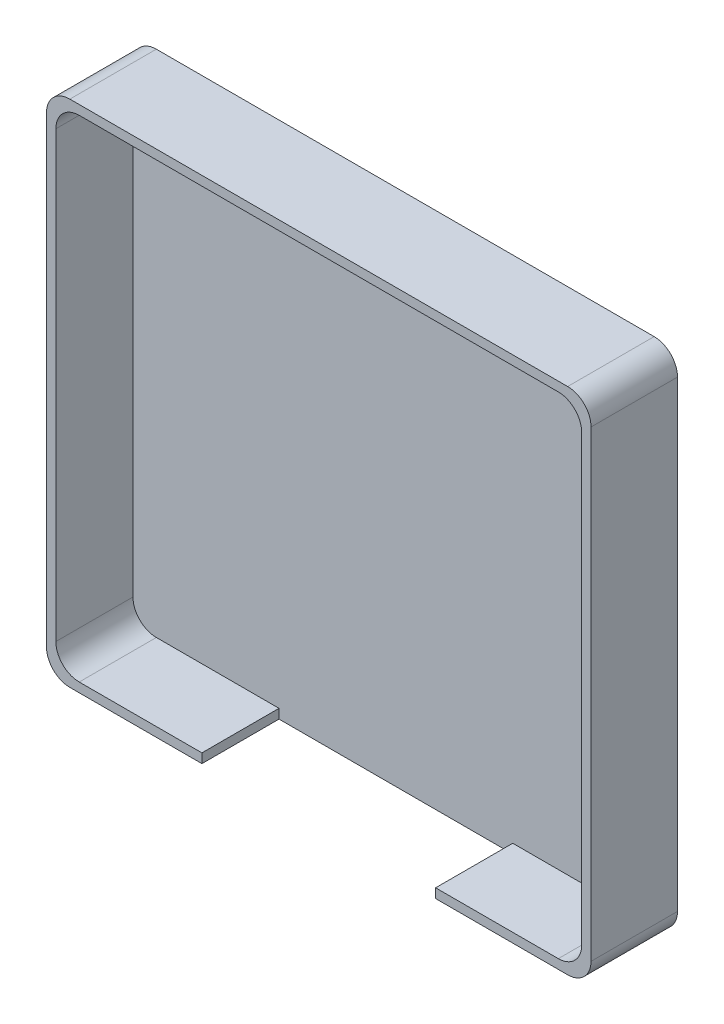
ISO-10303-21;
HEADER;
FILE_DESCRIPTION(('STEP AP214'),'2;1');
FILE_NAME('part.step','',(''),(''),'','','');
FILE_SCHEMA(('AUTOMOTIVE_DESIGN { 1 0 10303 214 1 1 1 1 }'));
ENDSEC;
DATA;
#1=APPLICATION_CONTEXT('core data for automotive mechanical design processes');
#2=APPLICATION_PROTOCOL_DEFINITION('international standard','automotive_design',2000,#1);
#3=PRODUCT_CONTEXT('',#1,'mechanical');
#4=PRODUCT('Part','Part','',(#3));
#5=PRODUCT_RELATED_PRODUCT_CATEGORY('part','',(#4));
#6=PRODUCT_DEFINITION_FORMATION('','',#4);
#7=PRODUCT_DEFINITION_CONTEXT('part definition',#1,'design');
#8=PRODUCT_DEFINITION('design','',#6,#7);
#9=PRODUCT_DEFINITION_SHAPE('','',#8);
#10=(LENGTH_UNIT() NAMED_UNIT(*) SI_UNIT(.MILLI.,.METRE.));
#11=(NAMED_UNIT(*) PLANE_ANGLE_UNIT() SI_UNIT($,.RADIAN.));
#12=(NAMED_UNIT(*) SI_UNIT($,.STERADIAN.) SOLID_ANGLE_UNIT());
#13=UNCERTAINTY_MEASURE_WITH_UNIT(LENGTH_MEASURE(1.E-05),#10,'distance_accuracy_value','');
#14=(GEOMETRIC_REPRESENTATION_CONTEXT(3) GLOBAL_UNCERTAINTY_ASSIGNED_CONTEXT((#13)) GLOBAL_UNIT_ASSIGNED_CONTEXT((#10,
#11,#12)) REPRESENTATION_CONTEXT('',''));
#15=CARTESIAN_POINT('',(0.,0.,0.));
#16=DIRECTION('',(0.,0.,1.));
#17=DIRECTION('',(1.,0.,0.));
#18=AXIS2_PLACEMENT_3D('',#15,#16,#17);
#19=CARTESIAN_POINT('',(22.5,-21.,0.8));
#20=DIRECTION('',(0.,-1.,0.));
#21=DIRECTION('',(1.,0.,0.));
#22=AXIS2_PLACEMENT_3D('',#19,#20,#21);
#23=PLANE('',#22);
#24=DIRECTION('',(1.,0.,0.));
#25=VECTOR('',#24,1.);
#26=CARTESIAN_POINT('',(22.5,-21.,7.4));
#27=LINE('',#26,#25);
#28=CARTESIAN_POINT('',(10.,-21.,7.4));
#29=VERTEX_POINT('',#28);
#30=CARTESIAN_POINT('',(20.5,-21.,7.4));
#31=VERTEX_POINT('',#30);
#32=EDGE_CURVE('E182',#29,#31,#27,.T.);
#33=ORIENTED_EDGE('',*,*,#32,.T.);
#34=DIRECTION('',(0.,0.,1.));
#35=VECTOR('',#34,1.);
#36=CARTESIAN_POINT('',(20.5,-21.,0.8));
#37=LINE('',#36,#35);
#38=CARTESIAN_POINT('',(20.5,-21.,0.8));
#39=VERTEX_POINT('',#38);
#40=EDGE_CURVE('E306',#31,#39,#37,.F.);
#41=ORIENTED_EDGE('',*,*,#40,.T.);
#42=DIRECTION('',(1.,0.,0.));
#43=VECTOR('',#42,1.);
#44=CARTESIAN_POINT('',(22.5,-21.,0.8));
#45=LINE('',#44,#43);
#46=CARTESIAN_POINT('',(10.,-21.,0.8));
#47=VERTEX_POINT('',#46);
#48=EDGE_CURVE('E212',#47,#39,#45,.T.);
#49=ORIENTED_EDGE('',*,*,#48,.F.);
#50=DIRECTION('',(0.,0.,-1.));
#51=VECTOR('',#50,1.);
#52=CARTESIAN_POINT('',(10.,-21.,7.4));
#53=LINE('',#52,#51);
#54=EDGE_CURVE('E192',#29,#47,#53,.T.);
#55=ORIENTED_EDGE('',*,*,#54,.F.);
#56=EDGE_LOOP('',(#33,#41,#49,#55));
#57=FACE_BOUND('',#56,.T.);
#58=ADVANCED_FACE('F33',(#57),#23,.F.);
#59=CARTESIAN_POINT('',(23.3,-21.8,7.4));
#60=DIRECTION('',(-1.,0.,0.));
#61=DIRECTION('',(0.,0.,1.));
#62=AXIS2_PLACEMENT_3D('',#59,#60,#61);
#63=PLANE('',#62);
#64=DIRECTION('',(0.,1.,0.));
#65=VECTOR('',#64,1.);
#66=CARTESIAN_POINT('',(23.3,-21.8,0.));
#67=LINE('',#66,#65);
#68=CARTESIAN_POINT('',(23.3,-19.8,0.));
#69=VERTEX_POINT('',#68);
#70=CARTESIAN_POINT('',(23.3,19.8,0.));
#71=VERTEX_POINT('',#70);
#72=EDGE_CURVE('E221',#69,#71,#67,.T.);
#73=ORIENTED_EDGE('',*,*,#72,.T.);
#74=DIRECTION('',(0.,0.,-1.));
#75=VECTOR('',#74,1.);
#76=CARTESIAN_POINT('',(23.3,19.8,7.4));
#77=LINE('',#76,#75);
#78=CARTESIAN_POINT('',(23.3,19.8,7.4));
#79=VERTEX_POINT('',#78);
#80=EDGE_CURVE('E264',#71,#79,#77,.F.);
#81=ORIENTED_EDGE('',*,*,#80,.T.);
#82=DIRECTION('',(0.,1.,0.));
#83=VECTOR('',#82,1.);
#84=CARTESIAN_POINT('',(23.3,-21.8,7.4));
#85=LINE('',#84,#83);
#86=CARTESIAN_POINT('',(23.3,-19.8,7.4));
#87=VERTEX_POINT('',#86);
#88=EDGE_CURVE('E227',#87,#79,#85,.T.);
#89=ORIENTED_EDGE('',*,*,#88,.F.);
#90=DIRECTION('',(0.,0.,-1.));
#91=VECTOR('',#90,1.);
#92=CARTESIAN_POINT('',(23.3,-19.8,7.4));
#93=LINE('',#92,#91);
#94=EDGE_CURVE('E261',#87,#69,#93,.T.);
#95=ORIENTED_EDGE('',*,*,#94,.T.);
#96=EDGE_LOOP('',(#73,#81,#89,#95));
#97=FACE_BOUND('',#96,.T.);
#98=ADVANCED_FACE('F355',(#97),#63,.F.);
#99=CARTESIAN_POINT('',(-23.3,21.8,7.4));
#100=DIRECTION('',(0.,-1.,0.));
#101=DIRECTION('',(0.,0.,-1.));
#102=AXIS2_PLACEMENT_3D('',#99,#100,#101);
#103=PLANE('',#102);
#104=DIRECTION('',(-1.,0.,0.));
#105=VECTOR('',#104,1.);
#106=CARTESIAN_POINT('',(-23.3,21.8,7.4));
#107=LINE('',#106,#105);
#108=CARTESIAN_POINT('',(21.3,21.8,7.4));
#109=VERTEX_POINT('',#108);
#110=CARTESIAN_POINT('',(-21.3,21.8,7.4));
#111=VERTEX_POINT('',#110);
#112=EDGE_CURVE('E229',#109,#111,#107,.T.);
#113=ORIENTED_EDGE('',*,*,#112,.F.);
#114=DIRECTION('',(0.,0.,-1.));
#115=VECTOR('',#114,1.);
#116=CARTESIAN_POINT('',(21.3,21.8,7.4));
#117=LINE('',#116,#115);
#118=CARTESIAN_POINT('',(21.3,21.8,0.));
#119=VERTEX_POINT('',#118);
#120=EDGE_CURVE('E250',#109,#119,#117,.T.);
#121=ORIENTED_EDGE('',*,*,#120,.T.);
#122=DIRECTION('',(-1.,0.,0.));
#123=VECTOR('',#122,1.);
#124=CARTESIAN_POINT('',(-23.3,21.8,0.));
#125=LINE('',#124,#123);
#126=CARTESIAN_POINT('',(-21.3,21.8,0.));
#127=VERTEX_POINT('',#126);
#128=EDGE_CURVE('E241',#119,#127,#125,.T.);
#129=ORIENTED_EDGE('',*,*,#128,.T.);
#130=DIRECTION('',(0.,0.,-1.));
#131=VECTOR('',#130,1.);
#132=CARTESIAN_POINT('',(-21.3,21.8,7.4));
#133=LINE('',#132,#131);
#134=EDGE_CURVE('E238',#127,#111,#133,.F.);
#135=ORIENTED_EDGE('',*,*,#134,.T.);
#136=EDGE_LOOP('',(#113,#121,#129,#135));
#137=FACE_BOUND('',#136,.T.);
#138=ADVANCED_FACE('F360',(#137),#103,.F.);
#139=CARTESIAN_POINT('',(-23.3,-21.8,7.4));
#140=DIRECTION('',(1.,0.,0.));
#141=DIRECTION('',(0.,0.,-1.));
#142=AXIS2_PLACEMENT_3D('',#139,#140,#141);
#143=PLANE('',#142);
#144=DIRECTION('',(0.,-1.,0.));
#145=VECTOR('',#144,1.);
#146=CARTESIAN_POINT('',(-23.3,-21.8,7.4));
#147=LINE('',#146,#145);
#148=CARTESIAN_POINT('',(-23.3,19.8,7.4));
#149=VERTEX_POINT('',#148);
#150=CARTESIAN_POINT('',(-23.3,-19.8,7.4));
#151=VERTEX_POINT('',#150);
#152=EDGE_CURVE('E233',#149,#151,#147,.T.);
#153=ORIENTED_EDGE('',*,*,#152,.F.);
#154=DIRECTION('',(0.,0.,-1.));
#155=VECTOR('',#154,1.);
#156=CARTESIAN_POINT('',(-23.3,19.8,7.4));
#157=LINE('',#156,#155);
#158=CARTESIAN_POINT('',(-23.3,19.8,0.));
#159=VERTEX_POINT('',#158);
#160=EDGE_CURVE('E281',#149,#159,#157,.T.);
#161=ORIENTED_EDGE('',*,*,#160,.T.);
#162=DIRECTION('',(0.,-1.,0.));
#163=VECTOR('',#162,1.);
#164=CARTESIAN_POINT('',(-23.3,-21.8,0.));
#165=LINE('',#164,#163);
#166=CARTESIAN_POINT('',(-23.3,-19.8,0.));
#167=VERTEX_POINT('',#166);
#168=EDGE_CURVE('E244',#159,#167,#165,.T.);
#169=ORIENTED_EDGE('',*,*,#168,.T.);
#170=DIRECTION('',(0.,0.,-1.));
#171=VECTOR('',#170,1.);
#172=CARTESIAN_POINT('',(-23.3,-19.8,7.4));
#173=LINE('',#172,#171);
#174=EDGE_CURVE('E279',#167,#151,#173,.F.);
#175=ORIENTED_EDGE('',*,*,#174,.T.);
#176=EDGE_LOOP('',(#153,#161,#169,#175));
#177=FACE_BOUND('',#176,.T.);
#178=ADVANCED_FACE('F407',(#177),#143,.F.);
#179=CARTESIAN_POINT('',(-23.3,-21.8,7.4));
#180=DIRECTION('',(0.,1.,0.));
#181=DIRECTION('',(0.,0.,1.));
#182=AXIS2_PLACEMENT_3D('',#179,#180,#181);
#183=PLANE('',#182);
#184=DIRECTION('',(1.,0.,0.));
#185=VECTOR('',#184,1.);
#186=CARTESIAN_POINT('',(-23.3,-21.8,0.));
#187=LINE('',#186,#185);
#188=CARTESIAN_POINT('',(-21.3,-21.8,0.));
#189=VERTEX_POINT('',#188);
#190=CARTESIAN_POINT('',(21.3,-21.8,0.));
#191=VERTEX_POINT('',#190);
#192=EDGE_CURVE('E230',#189,#191,#187,.T.);
#193=ORIENTED_EDGE('',*,*,#192,.T.);
#194=DIRECTION('',(0.,0.,-1.));
#195=VECTOR('',#194,1.);
#196=CARTESIAN_POINT('',(21.3,-21.8,7.4));
#197=LINE('',#196,#195);
#198=CARTESIAN_POINT('',(21.3,-21.8,7.4));
#199=VERTEX_POINT('',#198);
#200=EDGE_CURVE('E277',#191,#199,#197,.F.);
#201=ORIENTED_EDGE('',*,*,#200,.T.);
#202=DIRECTION('',(1.,0.,0.));
#203=VECTOR('',#202,1.);
#204=CARTESIAN_POINT('',(-23.3,-21.8,7.4));
#205=LINE('',#204,#203);
#206=CARTESIAN_POINT('',(10.,-21.8,7.4));
#207=VERTEX_POINT('',#206);
#208=EDGE_CURVE('E236',#207,#199,#205,.T.);
#209=ORIENTED_EDGE('',*,*,#208,.F.);
#210=DIRECTION('',(0.,0.,1.));
#211=VECTOR('',#210,1.);
#212=CARTESIAN_POINT('',(10.,-21.8,7.4));
#213=LINE('',#212,#211);
#214=CARTESIAN_POINT('',(10.,-21.8,0.800000000000005));
#215=VERTEX_POINT('',#214);
#216=EDGE_CURVE('E207',#215,#207,#213,.T.);
#217=ORIENTED_EDGE('',*,*,#216,.F.);
#218=DIRECTION('',(1.,0.,0.));
#219=VECTOR('',#218,1.);
#220=CARTESIAN_POINT('',(-10.,-21.8,0.800000000000005));
#221=LINE('',#220,#219);
#222=CARTESIAN_POINT('',(-10.,-21.8,0.800000000000005));
#223=VERTEX_POINT('',#222);
#224=EDGE_CURVE('E418',#223,#215,#221,.T.);
#225=ORIENTED_EDGE('',*,*,#224,.F.);
#226=DIRECTION('',(0.,0.,-1.));
#227=VECTOR('',#226,1.);
#228=CARTESIAN_POINT('',(-10.,-21.8,7.4));
#229=LINE('',#228,#227);
#230=CARTESIAN_POINT('',(-10.,-21.8,7.4));
#231=VERTEX_POINT('',#230);
#232=EDGE_CURVE('E415',#231,#223,#229,.T.);
#233=ORIENTED_EDGE('',*,*,#232,.F.);
#234=CARTESIAN_POINT('',(-21.3,-21.8,7.4));
#235=VERTEX_POINT('',#234);
#236=EDGE_CURVE('E197',#235,#231,#205,.T.);
#237=ORIENTED_EDGE('',*,*,#236,.F.);
#238=DIRECTION('',(0.,0.,-1.));
#239=VECTOR('',#238,1.);
#240=CARTESIAN_POINT('',(-21.3,-21.8,7.4));
#241=LINE('',#240,#239);
#242=EDGE_CURVE('E274',#235,#189,#241,.T.);
#243=ORIENTED_EDGE('',*,*,#242,.T.);
#244=EDGE_LOOP('',(#193,#201,#209,#217,#225,#233,#237,#243));
#245=FACE_BOUND('',#244,.T.);
#246=ADVANCED_FACE('F412',(#245),#183,.F.);
#247=CARTESIAN_POINT('',(0.,0.,7.4));
#248=DIRECTION('',(0.,0.,-1.));
#249=DIRECTION('',(-1.,0.,0.));
#250=AXIS2_PLACEMENT_3D('',#247,#248,#249);
#251=PLANE('',#250);
#252=ORIENTED_EDGE('',*,*,#88,.T.);
#253=CARTESIAN_POINT('',(21.3,19.8,7.4));
#254=DIRECTION('',(0.,0.,-1.));
#255=DIRECTION('',(-1.,0.,0.));
#256=AXIS2_PLACEMENT_3D('',#253,#254,#255);
#257=CIRCLE('',#256,2.);
#258=EDGE_CURVE('E272',#79,#109,#257,.F.);
#259=ORIENTED_EDGE('',*,*,#258,.T.);
#260=ORIENTED_EDGE('',*,*,#112,.T.);
#261=CARTESIAN_POINT('',(-21.3,19.8,7.4));
#262=DIRECTION('',(0.,0.,-1.));
#263=DIRECTION('',(-1.,0.,0.));
#264=AXIS2_PLACEMENT_3D('',#261,#262,#263);
#265=CIRCLE('',#264,2.);
#266=EDGE_CURVE('E268',#111,#149,#265,.F.);
#267=ORIENTED_EDGE('',*,*,#266,.T.);
#268=ORIENTED_EDGE('',*,*,#152,.T.);
#269=CARTESIAN_POINT('',(-21.3,-19.8,7.4));
#270=DIRECTION('',(0.,0.,-1.));
#271=DIRECTION('',(-1.,0.,0.));
#272=AXIS2_PLACEMENT_3D('',#269,#270,#271);
#273=CIRCLE('',#272,2.);
#274=EDGE_CURVE('E266',#151,#235,#273,.F.);
#275=ORIENTED_EDGE('',*,*,#274,.T.);
#276=ORIENTED_EDGE('',*,*,#236,.T.);
#277=DIRECTION('',(0.,-1.,0.));
#278=VECTOR('',#277,1.);
#279=CARTESIAN_POINT('',(-10.,21.801,7.4));
#280=LINE('',#279,#278);
#281=CARTESIAN_POINT('',(-10.,-21.,7.4));
#282=VERTEX_POINT('',#281);
#283=EDGE_CURVE('E189',#282,#231,#280,.T.);
#284=ORIENTED_EDGE('',*,*,#283,.F.);
#285=CARTESIAN_POINT('',(-20.5,-21.,7.4));
#286=VERTEX_POINT('',#285);
#287=EDGE_CURVE('E172',#286,#282,#27,.T.);
#288=ORIENTED_EDGE('',*,*,#287,.F.);
#289=CARTESIAN_POINT('',(-20.5,-19.,7.4));
#290=DIRECTION('',(0.,0.,-1.));
#291=DIRECTION('',(-1.,0.,0.));
#292=AXIS2_PLACEMENT_3D('',#289,#290,#291);
#293=CIRCLE('',#292,2.);
#294=CARTESIAN_POINT('',(-22.5,-19.,7.4));
#295=VERTEX_POINT('',#294);
#296=EDGE_CURVE('E310',#286,#295,#293,.T.);
#297=ORIENTED_EDGE('',*,*,#296,.T.);
#298=DIRECTION('',(0.,-1.,0.));
#299=VECTOR('',#298,1.);
#300=CARTESIAN_POINT('',(-22.5,-21.,7.4));
#301=LINE('',#300,#299);
#302=CARTESIAN_POINT('',(-22.5,19.,7.4));
#303=VERTEX_POINT('',#302);
#304=EDGE_CURVE('E200',#303,#295,#301,.T.);
#305=ORIENTED_EDGE('',*,*,#304,.F.);
#306=CARTESIAN_POINT('',(-20.5,19.,7.4));
#307=DIRECTION('',(0.,0.,-1.));
#308=DIRECTION('',(-1.,0.,0.));
#309=AXIS2_PLACEMENT_3D('',#306,#307,#308);
#310=CIRCLE('',#309,2.);
#311=CARTESIAN_POINT('',(-20.5,21.,7.4));
#312=VERTEX_POINT('',#311);
#313=EDGE_CURVE('E308',#303,#312,#310,.T.);
#314=ORIENTED_EDGE('',*,*,#313,.T.);
#315=DIRECTION('',(-1.,0.,0.));
#316=VECTOR('',#315,1.);
#317=CARTESIAN_POINT('',(22.5,21.,7.4));
#318=LINE('',#317,#316);
#319=CARTESIAN_POINT('',(20.5,21.,7.4));
#320=VERTEX_POINT('',#319);
#321=EDGE_CURVE('E213',#320,#312,#318,.T.);
#322=ORIENTED_EDGE('',*,*,#321,.F.);
#323=CARTESIAN_POINT('',(20.5,19.,7.4));
#324=DIRECTION('',(0.,0.,-1.));
#325=DIRECTION('',(-1.,0.,0.));
#326=AXIS2_PLACEMENT_3D('',#323,#324,#325);
#327=CIRCLE('',#326,2.);
#328=CARTESIAN_POINT('',(22.5,19.,7.4));
#329=VERTEX_POINT('',#328);
#330=EDGE_CURVE('E11',#320,#329,#327,.T.);
#331=ORIENTED_EDGE('',*,*,#330,.T.);
#332=DIRECTION('',(0.,1.,0.));
#333=VECTOR('',#332,1.);
#334=CARTESIAN_POINT('',(22.5,-21.,7.4));
#335=LINE('',#334,#333);
#336=CARTESIAN_POINT('',(22.5,-19.,7.4));
#337=VERTEX_POINT('',#336);
#338=EDGE_CURVE('E181',#337,#329,#335,.T.);
#339=ORIENTED_EDGE('',*,*,#338,.F.);
#340=CARTESIAN_POINT('',(20.5,-19.,7.4));
#341=DIRECTION('',(0.,0.,-1.));
#342=DIRECTION('',(-1.,0.,0.));
#343=AXIS2_PLACEMENT_3D('',#340,#341,#342);
#344=CIRCLE('',#343,2.);
#345=EDGE_CURVE('E41',#337,#31,#344,.T.);
#346=ORIENTED_EDGE('',*,*,#345,.T.);
#347=ORIENTED_EDGE('',*,*,#32,.F.);
#348=DIRECTION('',(0.,-1.,0.));
#349=VECTOR('',#348,1.);
#350=CARTESIAN_POINT('',(10.,21.801,7.4));
#351=LINE('',#350,#349);
#352=EDGE_CURVE('E198',#29,#207,#351,.T.);
#353=ORIENTED_EDGE('',*,*,#352,.T.);
#354=ORIENTED_EDGE('',*,*,#208,.T.);
#355=CARTESIAN_POINT('',(21.3,-19.8,7.4));
#356=DIRECTION('',(0.,0.,-1.));
#357=DIRECTION('',(-1.,0.,0.));
#358=AXIS2_PLACEMENT_3D('',#355,#356,#357);
#359=CIRCLE('',#358,2.);
#360=EDGE_CURVE('E270',#199,#87,#359,.F.);
#361=ORIENTED_EDGE('',*,*,#360,.T.);
#362=EDGE_LOOP('',(#252,#259,#260,#267,#268,#275,#276,#284,#288,#297,#305,#314,#322,#331,#339,
#346,#347,#353,#354,#361));
#363=FACE_BOUND('',#362,.T.);
#364=ADVANCED_FACE('F195',(#363),#251,.F.);
#365=CARTESIAN_POINT('',(0.,0.,0.));
#366=DIRECTION('',(0.,0.,-1.));
#367=DIRECTION('',(-1.,0.,0.));
#368=AXIS2_PLACEMENT_3D('',#365,#366,#367);
#369=PLANE('',#368);
#370=ORIENTED_EDGE('',*,*,#128,.F.);
#371=CARTESIAN_POINT('',(21.3,19.8,0.));
#372=DIRECTION('',(0.,0.,-1.));
#373=DIRECTION('',(-1.,0.,0.));
#374=AXIS2_PLACEMENT_3D('',#371,#372,#373);
#375=CIRCLE('',#374,2.);
#376=EDGE_CURVE('E259',#119,#71,#375,.T.);
#377=ORIENTED_EDGE('',*,*,#376,.T.);
#378=ORIENTED_EDGE('',*,*,#72,.F.);
#379=CARTESIAN_POINT('',(21.3,-19.8,0.));
#380=DIRECTION('',(0.,0.,-1.));
#381=DIRECTION('',(-1.,0.,0.));
#382=AXIS2_PLACEMENT_3D('',#379,#380,#381);
#383=CIRCLE('',#382,2.);
#384=EDGE_CURVE('E257',#69,#191,#383,.T.);
#385=ORIENTED_EDGE('',*,*,#384,.T.);
#386=ORIENTED_EDGE('',*,*,#192,.F.);
#387=CARTESIAN_POINT('',(-21.3,-19.8,0.));
#388=DIRECTION('',(0.,0.,-1.));
#389=DIRECTION('',(-1.,0.,0.));
#390=AXIS2_PLACEMENT_3D('',#387,#388,#389);
#391=CIRCLE('',#390,2.);
#392=EDGE_CURVE('E253',#189,#167,#391,.T.);
#393=ORIENTED_EDGE('',*,*,#392,.T.);
#394=ORIENTED_EDGE('',*,*,#168,.F.);
#395=CARTESIAN_POINT('',(-21.3,19.8,0.));
#396=DIRECTION('',(0.,0.,-1.));
#397=DIRECTION('',(-1.,0.,0.));
#398=AXIS2_PLACEMENT_3D('',#395,#396,#397);
#399=CIRCLE('',#398,2.);
#400=EDGE_CURVE('E255',#159,#127,#399,.T.);
#401=ORIENTED_EDGE('',*,*,#400,.T.);
#402=EDGE_LOOP('',(#370,#377,#378,#385,#386,#393,#394,#401));
#403=FACE_BOUND('',#402,.T.);
#404=ADVANCED_FACE('F435',(#403),#369,.T.);
#405=CARTESIAN_POINT('',(-22.5,-21.,0.8));
#406=DIRECTION('',(-1.,0.,0.));
#407=DIRECTION('',(0.,0.,1.));
#408=AXIS2_PLACEMENT_3D('',#405,#406,#407);
#409=PLANE('',#408);
#410=DIRECTION('',(0.,-1.,0.));
#411=VECTOR('',#410,1.);
#412=CARTESIAN_POINT('',(-22.5,-21.,0.8));
#413=LINE('',#412,#411);
#414=CARTESIAN_POINT('',(-22.5,19.,0.8));
#415=VERTEX_POINT('',#414);
#416=CARTESIAN_POINT('',(-22.5,-19.,0.8));
#417=VERTEX_POINT('',#416);
#418=EDGE_CURVE('E209',#415,#417,#413,.T.);
#419=ORIENTED_EDGE('',*,*,#418,.F.);
#420=DIRECTION('',(0.,0.,1.));
#421=VECTOR('',#420,1.);
#422=CARTESIAN_POINT('',(-22.5,19.,7.4));
#423=LINE('',#422,#421);
#424=EDGE_CURVE('E286',#415,#303,#423,.T.);
#425=ORIENTED_EDGE('',*,*,#424,.T.);
#426=ORIENTED_EDGE('',*,*,#304,.T.);
#427=DIRECTION('',(0.,0.,1.));
#428=VECTOR('',#427,1.);
#429=CARTESIAN_POINT('',(-22.5,-19.,0.8));
#430=LINE('',#429,#428);
#431=EDGE_CURVE('E284',#295,#417,#430,.F.);
#432=ORIENTED_EDGE('',*,*,#431,.T.);
#433=EDGE_LOOP('',(#419,#425,#426,#432));
#434=FACE_BOUND('',#433,.T.);
#435=ADVANCED_FACE('F338',(#434),#409,.F.);
#436=CARTESIAN_POINT('',(22.5,21.,0.8));
#437=DIRECTION('',(0.,1.,0.));
#438=DIRECTION('',(-1.,0.,0.));
#439=AXIS2_PLACEMENT_3D('',#436,#437,#438);
#440=PLANE('',#439);
#441=ORIENTED_EDGE('',*,*,#321,.T.);
#442=DIRECTION('',(0.,0.,1.));
#443=VECTOR('',#442,1.);
#444=CARTESIAN_POINT('',(-20.5,21.,0.8));
#445=LINE('',#444,#443);
#446=CARTESIAN_POINT('',(-20.5,21.,0.8));
#447=VERTEX_POINT('',#446);
#448=EDGE_CURVE('E292',#312,#447,#445,.F.);
#449=ORIENTED_EDGE('',*,*,#448,.T.);
#450=DIRECTION('',(-1.,0.,0.));
#451=VECTOR('',#450,1.);
#452=CARTESIAN_POINT('',(22.5,21.,0.8));
#453=LINE('',#452,#451);
#454=CARTESIAN_POINT('',(20.5,21.,0.8));
#455=VERTEX_POINT('',#454);
#456=EDGE_CURVE('E218',#455,#447,#453,.T.);
#457=ORIENTED_EDGE('',*,*,#456,.F.);
#458=DIRECTION('',(0.,0.,1.));
#459=VECTOR('',#458,1.);
#460=CARTESIAN_POINT('',(20.5,21.,7.4));
#461=LINE('',#460,#459);
#462=EDGE_CURVE('E289',#455,#320,#461,.T.);
#463=ORIENTED_EDGE('',*,*,#462,.T.);
#464=EDGE_LOOP('',(#441,#449,#457,#463));
#465=FACE_BOUND('',#464,.T.);
#466=ADVANCED_FACE('F329',(#465),#440,.F.);
#467=CARTESIAN_POINT('',(22.5,-21.,0.8));
#468=DIRECTION('',(1.,0.,0.));
#469=DIRECTION('',(0.,0.,-1.));
#470=AXIS2_PLACEMENT_3D('',#467,#468,#469);
#471=PLANE('',#470);
#472=DIRECTION('',(0.,1.,0.));
#473=VECTOR('',#472,1.);
#474=CARTESIAN_POINT('',(22.5,-21.,0.8));
#475=LINE('',#474,#473);
#476=CARTESIAN_POINT('',(22.5,-19.,0.8));
#477=VERTEX_POINT('',#476);
#478=CARTESIAN_POINT('',(22.5,19.,0.8));
#479=VERTEX_POINT('',#478);
#480=EDGE_CURVE('E216',#477,#479,#475,.T.);
#481=ORIENTED_EDGE('',*,*,#480,.F.);
#482=DIRECTION('',(0.,0.,1.));
#483=VECTOR('',#482,1.);
#484=CARTESIAN_POINT('',(22.5,-19.,7.4));
#485=LINE('',#484,#483);
#486=EDGE_CURVE('E303',#477,#337,#485,.T.);
#487=ORIENTED_EDGE('',*,*,#486,.T.);
#488=ORIENTED_EDGE('',*,*,#338,.T.);
#489=DIRECTION('',(0.,0.,1.));
#490=VECTOR('',#489,1.);
#491=CARTESIAN_POINT('',(22.5,19.,0.8));
#492=LINE('',#491,#490);
#493=EDGE_CURVE('E48',#329,#479,#492,.F.);
#494=ORIENTED_EDGE('',*,*,#493,.T.);
#495=EDGE_LOOP('',(#481,#487,#488,#494));
#496=FACE_BOUND('',#495,.T.);
#497=ADVANCED_FACE('F321',(#496),#471,.F.);
#498=CARTESIAN_POINT('',(-20.5,-21.,0.8));
#499=VERTEX_POINT('',#498);
#500=CARTESIAN_POINT('',(-9.99999999999999,-21.,0.8));
#501=VERTEX_POINT('',#500);
#502=EDGE_CURVE('E214',#499,#501,#45,.T.);
#503=ORIENTED_EDGE('',*,*,#502,.F.);
#504=DIRECTION('',(0.,0.,1.));
#505=VECTOR('',#504,1.);
#506=CARTESIAN_POINT('',(-20.5,-21.,7.4));
#507=LINE('',#506,#505);
#508=EDGE_CURVE('E178',#499,#286,#507,.T.);
#509=ORIENTED_EDGE('',*,*,#508,.T.);
#510=ORIENTED_EDGE('',*,*,#287,.T.);
#511=DIRECTION('',(0.,0.,1.));
#512=VECTOR('',#511,1.);
#513=CARTESIAN_POINT('',(-10.,-21.,7.4));
#514=LINE('',#513,#512);
#515=EDGE_CURVE('E176',#501,#282,#514,.T.);
#516=ORIENTED_EDGE('',*,*,#515,.F.);
#517=EDGE_LOOP('',(#503,#509,#510,#516));
#518=FACE_BOUND('',#517,.T.);
#519=ADVANCED_FACE('F175',(#518),#23,.F.);
#520=CARTESIAN_POINT('',(0.,0.,0.8));
#521=DIRECTION('',(0.,0.,1.));
#522=DIRECTION('',(1.,0.,0.));
#523=AXIS2_PLACEMENT_3D('',#520,#521,#522);
#524=PLANE('',#523);
#525=ORIENTED_EDGE('',*,*,#456,.T.);
#526=CARTESIAN_POINT('',(-20.5,19.,0.8));
#527=DIRECTION('',(0.,0.,1.));
#528=DIRECTION('',(1.,0.,0.));
#529=AXIS2_PLACEMENT_3D('',#526,#527,#528);
#530=CIRCLE('',#529,2.);
#531=EDGE_CURVE('E299',#447,#415,#530,.T.);
#532=ORIENTED_EDGE('',*,*,#531,.T.);
#533=ORIENTED_EDGE('',*,*,#418,.T.);
#534=CARTESIAN_POINT('',(-20.5,-19.,0.8));
#535=DIRECTION('',(0.,0.,1.));
#536=DIRECTION('',(1.,0.,0.));
#537=AXIS2_PLACEMENT_3D('',#534,#535,#536);
#538=CIRCLE('',#537,2.);
#539=EDGE_CURVE('E297',#417,#499,#538,.T.);
#540=ORIENTED_EDGE('',*,*,#539,.T.);
#541=ORIENTED_EDGE('',*,*,#502,.T.);
#542=DIRECTION('',(0.,-1.,0.));
#543=VECTOR('',#542,1.);
#544=CARTESIAN_POINT('',(-10.,21.801,0.800000000000005));
#545=LINE('',#544,#543);
#546=EDGE_CURVE('E191',#501,#223,#545,.T.);
#547=ORIENTED_EDGE('',*,*,#546,.T.);
#548=ORIENTED_EDGE('',*,*,#224,.T.);
#549=DIRECTION('',(0.,-1.,0.));
#550=VECTOR('',#549,1.);
#551=CARTESIAN_POINT('',(10.,21.801,0.800000000000005));
#552=LINE('',#551,#550);
#553=EDGE_CURVE('E203',#47,#215,#552,.T.);
#554=ORIENTED_EDGE('',*,*,#553,.F.);
#555=ORIENTED_EDGE('',*,*,#48,.T.);
#556=CARTESIAN_POINT('',(20.5,-19.,0.8));
#557=DIRECTION('',(0.,0.,1.));
#558=DIRECTION('',(1.,0.,0.));
#559=AXIS2_PLACEMENT_3D('',#556,#557,#558);
#560=CIRCLE('',#559,2.);
#561=EDGE_CURVE('E55',#39,#477,#560,.T.);
#562=ORIENTED_EDGE('',*,*,#561,.T.);
#563=ORIENTED_EDGE('',*,*,#480,.T.);
#564=CARTESIAN_POINT('',(20.5,19.,0.8));
#565=DIRECTION('',(0.,0.,1.));
#566=DIRECTION('',(1.,0.,0.));
#567=AXIS2_PLACEMENT_3D('',#564,#565,#566);
#568=CIRCLE('',#567,2.);
#569=EDGE_CURVE('E294',#479,#455,#568,.T.);
#570=ORIENTED_EDGE('',*,*,#569,.T.);
#571=EDGE_LOOP('',(#525,#532,#533,#540,#541,#547,#548,#554,#555,#562,#563,#570));
#572=FACE_BOUND('',#571,.T.);
#573=ADVANCED_FACE('F323',(#572),#524,.T.);
#574=CARTESIAN_POINT('',(10.,21.801,7.4));
#575=DIRECTION('',(1.,0.,0.));
#576=DIRECTION('',(0.,0.,-1.));
#577=AXIS2_PLACEMENT_3D('',#574,#575,#576);
#578=PLANE('',#577);
#579=ORIENTED_EDGE('',*,*,#54,.T.);
#580=ORIENTED_EDGE('',*,*,#553,.T.);
#581=ORIENTED_EDGE('',*,*,#216,.T.);
#582=ORIENTED_EDGE('',*,*,#352,.F.);
#583=EDGE_LOOP('',(#579,#580,#581,#582));
#584=FACE_BOUND('',#583,.T.);
#585=ADVANCED_FACE('F370',(#584),#578,.F.);
#586=CARTESIAN_POINT('',(-10.,21.801,7.4));
#587=DIRECTION('',(-1.,0.,0.));
#588=DIRECTION('',(0.,0.,1.));
#589=AXIS2_PLACEMENT_3D('',#586,#587,#588);
#590=PLANE('',#589);
#591=ORIENTED_EDGE('',*,*,#515,.T.);
#592=ORIENTED_EDGE('',*,*,#283,.T.);
#593=ORIENTED_EDGE('',*,*,#232,.T.);
#594=ORIENTED_EDGE('',*,*,#546,.F.);
#595=EDGE_LOOP('',(#591,#592,#593,#594));
#596=FACE_BOUND('',#595,.T.);
#597=ADVANCED_FACE('F187',(#596),#590,.F.);
#598=CARTESIAN_POINT('',(21.3,19.8,7.4));
#599=DIRECTION('',(0.,0.,-1.));
#600=DIRECTION('',(-1.,0.,0.));
#601=AXIS2_PLACEMENT_3D('',#598,#599,#600);
#602=CYLINDRICAL_SURFACE('',#601,2.);
#603=ORIENTED_EDGE('',*,*,#258,.F.);
#604=ORIENTED_EDGE('',*,*,#80,.F.);
#605=ORIENTED_EDGE('',*,*,#376,.F.);
#606=ORIENTED_EDGE('',*,*,#120,.F.);
#607=EDGE_LOOP('',(#603,#604,#605,#606));
#608=FACE_BOUND('',#607,.T.);
#609=ADVANCED_FACE('F381',(#608),#602,.T.);
#610=CARTESIAN_POINT('',(21.3,-19.8,7.4));
#611=DIRECTION('',(0.,0.,-1.));
#612=DIRECTION('',(-1.,0.,0.));
#613=AXIS2_PLACEMENT_3D('',#610,#611,#612);
#614=CYLINDRICAL_SURFACE('',#613,2.);
#615=ORIENTED_EDGE('',*,*,#360,.F.);
#616=ORIENTED_EDGE('',*,*,#200,.F.);
#617=ORIENTED_EDGE('',*,*,#384,.F.);
#618=ORIENTED_EDGE('',*,*,#94,.F.);
#619=EDGE_LOOP('',(#615,#616,#617,#618));
#620=FACE_BOUND('',#619,.T.);
#621=ADVANCED_FACE('F385',(#620),#614,.T.);
#622=CARTESIAN_POINT('',(-21.3,19.8,7.4));
#623=DIRECTION('',(0.,0.,-1.));
#624=DIRECTION('',(-1.,0.,0.));
#625=AXIS2_PLACEMENT_3D('',#622,#623,#624);
#626=CYLINDRICAL_SURFACE('',#625,2.);
#627=ORIENTED_EDGE('',*,*,#266,.F.);
#628=ORIENTED_EDGE('',*,*,#134,.F.);
#629=ORIENTED_EDGE('',*,*,#400,.F.);
#630=ORIENTED_EDGE('',*,*,#160,.F.);
#631=EDGE_LOOP('',(#627,#628,#629,#630));
#632=FACE_BOUND('',#631,.T.);
#633=ADVANCED_FACE('F352',(#632),#626,.T.);
#634=CARTESIAN_POINT('',(-20.5,19.,0.8));
#635=DIRECTION('',(0.,0.,-1.));
#636=DIRECTION('',(-1.,0.,0.));
#637=AXIS2_PLACEMENT_3D('',#634,#635,#636);
#638=CYLINDRICAL_SURFACE('',#637,2.);
#639=ORIENTED_EDGE('',*,*,#531,.F.);
#640=ORIENTED_EDGE('',*,*,#448,.F.);
#641=ORIENTED_EDGE('',*,*,#313,.F.);
#642=ORIENTED_EDGE('',*,*,#424,.F.);
#643=EDGE_LOOP('',(#639,#640,#641,#642));
#644=FACE_BOUND('',#643,.T.);
#645=ADVANCED_FACE('F335',(#644),#638,.F.);
#646=CARTESIAN_POINT('',(-20.5,-19.,0.8));
#647=DIRECTION('',(0.,0.,-1.));
#648=DIRECTION('',(-1.,0.,0.));
#649=AXIS2_PLACEMENT_3D('',#646,#647,#648);
#650=CYLINDRICAL_SURFACE('',#649,2.);
#651=ORIENTED_EDGE('',*,*,#539,.F.);
#652=ORIENTED_EDGE('',*,*,#431,.F.);
#653=ORIENTED_EDGE('',*,*,#296,.F.);
#654=ORIENTED_EDGE('',*,*,#508,.F.);
#655=EDGE_LOOP('',(#651,#652,#653,#654));
#656=FACE_BOUND('',#655,.T.);
#657=ADVANCED_FACE('F342',(#656),#650,.F.);
#658=CARTESIAN_POINT('',(-21.3,-19.8,7.4));
#659=DIRECTION('',(0.,0.,-1.));
#660=DIRECTION('',(-1.,0.,0.));
#661=AXIS2_PLACEMENT_3D('',#658,#659,#660);
#662=CYLINDRICAL_SURFACE('',#661,2.);
#663=ORIENTED_EDGE('',*,*,#274,.F.);
#664=ORIENTED_EDGE('',*,*,#174,.F.);
#665=ORIENTED_EDGE('',*,*,#392,.F.);
#666=ORIENTED_EDGE('',*,*,#242,.F.);
#667=EDGE_LOOP('',(#663,#664,#665,#666));
#668=FACE_BOUND('',#667,.T.);
#669=ADVANCED_FACE('F344',(#668),#662,.T.);
#670=CARTESIAN_POINT('',(20.5,-19.,0.8));
#671=DIRECTION('',(0.,0.,-1.));
#672=DIRECTION('',(-1.,0.,0.));
#673=AXIS2_PLACEMENT_3D('',#670,#671,#672);
#674=CYLINDRICAL_SURFACE('',#673,2.);
#675=ORIENTED_EDGE('',*,*,#561,.F.);
#676=ORIENTED_EDGE('',*,*,#40,.F.);
#677=ORIENTED_EDGE('',*,*,#345,.F.);
#678=ORIENTED_EDGE('',*,*,#486,.F.);
#679=EDGE_LOOP('',(#675,#676,#677,#678));
#680=FACE_BOUND('',#679,.T.);
#681=ADVANCED_FACE('F320',(#680),#674,.F.);
#682=CARTESIAN_POINT('',(20.5,19.,0.8));
#683=DIRECTION('',(0.,0.,-1.));
#684=DIRECTION('',(-1.,0.,0.));
#685=AXIS2_PLACEMENT_3D('',#682,#683,#684);
#686=CYLINDRICAL_SURFACE('',#685,2.);
#687=ORIENTED_EDGE('',*,*,#569,.F.);
#688=ORIENTED_EDGE('',*,*,#493,.F.);
#689=ORIENTED_EDGE('',*,*,#330,.F.);
#690=ORIENTED_EDGE('',*,*,#462,.F.);
#691=EDGE_LOOP('',(#687,#688,#689,#690));
#692=FACE_BOUND('',#691,.T.);
#693=ADVANCED_FACE('F35',(#692),#686,.F.);
#694=CLOSED_SHELL('',(#58,#98,#138,#178,#246,#364,#404,#435,#466,#497,#519,#573,#585,#597,#609,
#621,#633,#645,#657,#669,#681,#693));
#695=MANIFOLD_SOLID_BREP('B2',#694);
#696=ADVANCED_BREP_SHAPE_REPRESENTATION('',(#18,#695),#14);
#697=SHAPE_DEFINITION_REPRESENTATION(#9,#696);
ENDSEC;
END-ISO-10303-21;
